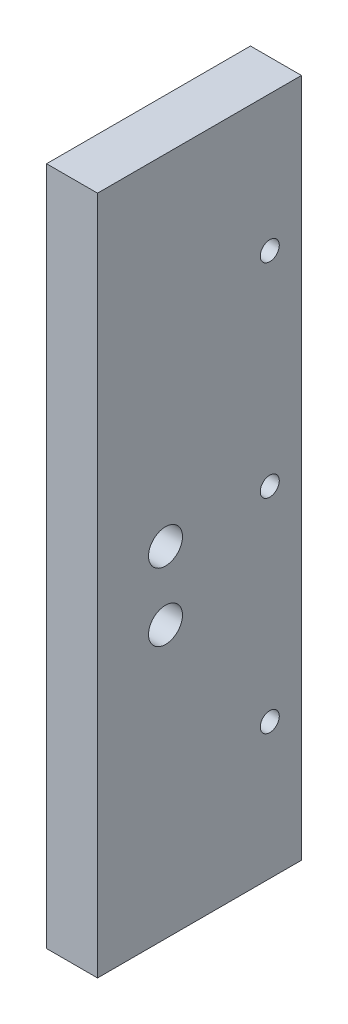
ISO-10303-21;
HEADER;
FILE_DESCRIPTION(('STEP AP214'),'2;1');
FILE_NAME('part.step','',(''),(''),'','','');
FILE_SCHEMA(('AUTOMOTIVE_DESIGN { 1 0 10303 214 1 1 1 1 }'));
ENDSEC;
DATA;
#1=APPLICATION_CONTEXT('core data for automotive mechanical design processes');
#2=APPLICATION_PROTOCOL_DEFINITION('international standard','automotive_design',2000,#1);
#3=PRODUCT_CONTEXT('',#1,'mechanical');
#4=PRODUCT('Part','Part','',(#3));
#5=PRODUCT_RELATED_PRODUCT_CATEGORY('part','',(#4));
#6=PRODUCT_DEFINITION_FORMATION('','',#4);
#7=PRODUCT_DEFINITION_CONTEXT('part definition',#1,'design');
#8=PRODUCT_DEFINITION('design','',#6,#7);
#9=PRODUCT_DEFINITION_SHAPE('','',#8);
#10=(LENGTH_UNIT() NAMED_UNIT(*) SI_UNIT(.MILLI.,.METRE.));
#11=(NAMED_UNIT(*) PLANE_ANGLE_UNIT() SI_UNIT($,.RADIAN.));
#12=(NAMED_UNIT(*) SI_UNIT($,.STERADIAN.) SOLID_ANGLE_UNIT());
#13=UNCERTAINTY_MEASURE_WITH_UNIT(LENGTH_MEASURE(1.E-05),#10,'distance_accuracy_value','');
#14=(GEOMETRIC_REPRESENTATION_CONTEXT(3) GLOBAL_UNCERTAINTY_ASSIGNED_CONTEXT((#13)) GLOBAL_UNIT_ASSIGNED_CONTEXT((#10,
#11,#12)) REPRESENTATION_CONTEXT('',''));
#15=CARTESIAN_POINT('',(0.,0.,0.));
#16=DIRECTION('',(0.,0.,1.));
#17=DIRECTION('',(1.,0.,0.));
#18=AXIS2_PLACEMENT_3D('',#15,#16,#17);
#19=CARTESIAN_POINT('',(0.,0.,38.1));
#20=DIRECTION('',(1.,0.,0.));
#21=DIRECTION('',(0.,0.,-1.));
#22=AXIS2_PLACEMENT_3D('',#19,#20,#21);
#23=PLANE('',#22);
#24=CARTESIAN_POINT('',(0.,50.8,25.4));
#25=DIRECTION('',(1.,0.,0.));
#26=DIRECTION('',(0.,0.,-1.));
#27=AXIS2_PLACEMENT_3D('',#24,#25,#26);
#28=CIRCLE('',#27,3.175);
#29=CARTESIAN_POINT('',(0.,50.8,22.225));
#30=VERTEX_POINT('',#29);
#31=EDGE_CURVE('E132',#30,#30,#28,.T.);
#32=ORIENTED_EDGE('',*,*,#31,.T.);
#33=EDGE_LOOP('',(#32));
#34=FACE_BOUND('',#33,.T.);
#35=CARTESIAN_POINT('',(0.,63.5,25.4));
#36=DIRECTION('',(1.,0.,0.));
#37=DIRECTION('',(0.,0.,-1.));
#38=AXIS2_PLACEMENT_3D('',#35,#36,#37);
#39=CIRCLE('',#38,3.175);
#40=CARTESIAN_POINT('',(0.,63.5,22.225));
#41=VERTEX_POINT('',#40);
#42=EDGE_CURVE('E124',#41,#41,#39,.T.);
#43=ORIENTED_EDGE('',*,*,#42,.T.);
#44=EDGE_LOOP('',(#43));
#45=FACE_BOUND('',#44,.T.);
#46=CARTESIAN_POINT('',(0.,25.4,5.91820000000001));
#47=DIRECTION('',(-1.,0.,0.));
#48=DIRECTION('',(0.,0.,1.));
#49=AXIS2_PLACEMENT_3D('',#46,#47,#48);
#50=CIRCLE('',#49,1.778);
#51=CARTESIAN_POINT('',(0.,25.4,7.69620000000001));
#52=VERTEX_POINT('',#51);
#53=EDGE_CURVE('E121',#52,#52,#50,.T.);
#54=ORIENTED_EDGE('',*,*,#53,.F.);
#55=EDGE_LOOP('',(#54));
#56=FACE_BOUND('',#55,.T.);
#57=CARTESIAN_POINT('',(0.,63.5,5.91820000000001));
#58=DIRECTION('',(-1.,0.,0.));
#59=DIRECTION('',(0.,0.,1.));
#60=AXIS2_PLACEMENT_3D('',#57,#58,#59);
#61=CIRCLE('',#60,1.778);
#62=CARTESIAN_POINT('',(0.,63.5,7.69620000000001));
#63=VERTEX_POINT('',#62);
#64=EDGE_CURVE('E115',#63,#63,#61,.T.);
#65=ORIENTED_EDGE('',*,*,#64,.F.);
#66=EDGE_LOOP('',(#65));
#67=FACE_BOUND('',#66,.T.);
#68=CARTESIAN_POINT('',(0.,101.6,5.9182));
#69=DIRECTION('',(-1.,0.,0.));
#70=DIRECTION('',(0.,0.,1.));
#71=AXIS2_PLACEMENT_3D('',#68,#69,#70);
#72=CIRCLE('',#71,1.778);
#73=CARTESIAN_POINT('',(0.,101.6,7.6962));
#74=VERTEX_POINT('',#73);
#75=EDGE_CURVE('E109',#74,#74,#72,.T.);
#76=ORIENTED_EDGE('',*,*,#75,.F.);
#77=EDGE_LOOP('',(#76));
#78=FACE_BOUND('',#77,.T.);
#79=DIRECTION('',(0.,-1.,0.));
#80=VECTOR('',#79,1.);
#81=CARTESIAN_POINT('',(0.,0.,0.));
#82=LINE('',#81,#80);
#83=CARTESIAN_POINT('',(0.,127.,0.));
#84=VERTEX_POINT('',#83);
#85=CARTESIAN_POINT('',(0.,0.,0.));
#86=VERTEX_POINT('',#85);
#87=EDGE_CURVE('E95',#84,#86,#82,.T.);
#88=ORIENTED_EDGE('',*,*,#87,.T.);
#89=DIRECTION('',(0.,0.,-1.));
#90=VECTOR('',#89,1.);
#91=CARTESIAN_POINT('',(0.,0.,38.1));
#92=LINE('',#91,#90);
#93=CARTESIAN_POINT('',(0.,0.,38.1));
#94=VERTEX_POINT('',#93);
#95=EDGE_CURVE('E11',#94,#86,#92,.T.);
#96=ORIENTED_EDGE('',*,*,#95,.F.);
#97=DIRECTION('',(0.,-1.,0.));
#98=VECTOR('',#97,1.);
#99=CARTESIAN_POINT('',(0.,0.,38.1));
#100=LINE('',#99,#98);
#101=CARTESIAN_POINT('',(0.,127.,38.1));
#102=VERTEX_POINT('',#101);
#103=EDGE_CURVE('E83',#102,#94,#100,.T.);
#104=ORIENTED_EDGE('',*,*,#103,.F.);
#105=DIRECTION('',(0.,0.,-1.));
#106=VECTOR('',#105,1.);
#107=CARTESIAN_POINT('',(0.,127.,38.1));
#108=LINE('',#107,#106);
#109=EDGE_CURVE('E91',#102,#84,#108,.T.);
#110=ORIENTED_EDGE('',*,*,#109,.T.);
#111=EDGE_LOOP('',(#88,#96,#104,#110));
#112=FACE_BOUND('',#111,.T.);
#113=ADVANCED_FACE('F32',(#34,#45,#56,#67,#78,#112),#23,.F.);
#114=CARTESIAN_POINT('',(0.,0.,38.1));
#115=DIRECTION('',(0.,1.,0.));
#116=DIRECTION('',(0.,0.,1.));
#117=AXIS2_PLACEMENT_3D('',#114,#115,#116);
#118=PLANE('',#117);
#119=DIRECTION('',(1.,0.,0.));
#120=VECTOR('',#119,1.);
#121=CARTESIAN_POINT('',(0.,0.,0.));
#122=LINE('',#121,#120);
#123=CARTESIAN_POINT('',(9.52500000000001,0.,0.));
#124=VERTEX_POINT('',#123);
#125=EDGE_CURVE('E87',#86,#124,#122,.T.);
#126=ORIENTED_EDGE('',*,*,#125,.T.);
#127=DIRECTION('',(0.,0.,-1.));
#128=VECTOR('',#127,1.);
#129=CARTESIAN_POINT('',(9.52500000000001,0.,38.1));
#130=LINE('',#129,#128);
#131=CARTESIAN_POINT('',(9.52500000000001,0.,38.1));
#132=VERTEX_POINT('',#131);
#133=EDGE_CURVE('E40',#132,#124,#130,.T.);
#134=ORIENTED_EDGE('',*,*,#133,.F.);
#135=DIRECTION('',(1.,0.,0.));
#136=VECTOR('',#135,1.);
#137=CARTESIAN_POINT('',(0.,0.,38.1));
#138=LINE('',#137,#136);
#139=EDGE_CURVE('E78',#94,#132,#138,.T.);
#140=ORIENTED_EDGE('',*,*,#139,.F.);
#141=ORIENTED_EDGE('',*,*,#95,.T.);
#142=EDGE_LOOP('',(#126,#134,#140,#141));
#143=FACE_BOUND('',#142,.T.);
#144=ADVANCED_FACE('F86',(#143),#118,.F.);
#145=CARTESIAN_POINT('',(9.52500000000001,0.,38.1));
#146=DIRECTION('',(-1.,0.,0.));
#147=DIRECTION('',(0.,-1.,0.));
#148=AXIS2_PLACEMENT_3D('',#145,#146,#147);
#149=PLANE('',#148);
#150=CARTESIAN_POINT('',(9.525,50.8,25.4));
#151=DIRECTION('',(1.,0.,0.));
#152=DIRECTION('',(0.,1.,0.));
#153=AXIS2_PLACEMENT_3D('',#150,#151,#152);
#154=CIRCLE('',#153,3.175);
#155=CARTESIAN_POINT('',(9.525,53.975,25.4));
#156=VERTEX_POINT('',#155);
#157=EDGE_CURVE('E135',#156,#156,#154,.T.);
#158=ORIENTED_EDGE('',*,*,#157,.F.);
#159=EDGE_LOOP('',(#158));
#160=FACE_BOUND('',#159,.T.);
#161=CARTESIAN_POINT('',(9.525,63.5,25.4));
#162=DIRECTION('',(1.,0.,0.));
#163=DIRECTION('',(0.,1.,0.));
#164=AXIS2_PLACEMENT_3D('',#161,#162,#163);
#165=CIRCLE('',#164,3.175);
#166=CARTESIAN_POINT('',(9.525,66.675,25.4));
#167=VERTEX_POINT('',#166);
#168=EDGE_CURVE('E129',#167,#167,#165,.T.);
#169=ORIENTED_EDGE('',*,*,#168,.F.);
#170=EDGE_LOOP('',(#169));
#171=FACE_BOUND('',#170,.T.);
#172=CARTESIAN_POINT('',(9.52500000000001,25.4,5.91820000000001));
#173=DIRECTION('',(-1.,0.,0.));
#174=DIRECTION('',(0.,0.,1.));
#175=AXIS2_PLACEMENT_3D('',#172,#173,#174);
#176=CIRCLE('',#175,1.778);
#177=CARTESIAN_POINT('',(9.52500000000001,25.4,7.69620000000001));
#178=VERTEX_POINT('',#177);
#179=EDGE_CURVE('E118',#178,#178,#176,.T.);
#180=ORIENTED_EDGE('',*,*,#179,.T.);
#181=EDGE_LOOP('',(#180));
#182=FACE_BOUND('',#181,.T.);
#183=CARTESIAN_POINT('',(9.52500000000001,63.5,5.91820000000001));
#184=DIRECTION('',(-1.,0.,0.));
#185=DIRECTION('',(0.,0.,1.));
#186=AXIS2_PLACEMENT_3D('',#183,#184,#185);
#187=CIRCLE('',#186,1.778);
#188=CARTESIAN_POINT('',(9.52500000000001,63.5,7.69620000000001));
#189=VERTEX_POINT('',#188);
#190=EDGE_CURVE('E112',#189,#189,#187,.T.);
#191=ORIENTED_EDGE('',*,*,#190,.T.);
#192=EDGE_LOOP('',(#191));
#193=FACE_BOUND('',#192,.T.);
#194=CARTESIAN_POINT('',(9.52500000000001,101.6,5.9182));
#195=DIRECTION('',(-1.,0.,0.));
#196=DIRECTION('',(0.,0.,1.));
#197=AXIS2_PLACEMENT_3D('',#194,#195,#196);
#198=CIRCLE('',#197,1.778);
#199=CARTESIAN_POINT('',(9.52500000000001,101.6,7.6962));
#200=VERTEX_POINT('',#199);
#201=EDGE_CURVE('E98',#200,#200,#198,.T.);
#202=ORIENTED_EDGE('',*,*,#201,.T.);
#203=EDGE_LOOP('',(#202));
#204=FACE_BOUND('',#203,.T.);
#205=DIRECTION('',(0.,1.,0.));
#206=VECTOR('',#205,1.);
#207=CARTESIAN_POINT('',(9.52500000000001,0.,0.));
#208=LINE('',#207,#206);
#209=CARTESIAN_POINT('',(9.525,127.,0.));
#210=VERTEX_POINT('',#209);
#211=EDGE_CURVE('E65',#124,#210,#208,.T.);
#212=ORIENTED_EDGE('',*,*,#211,.T.);
#213=DIRECTION('',(0.,0.,-1.));
#214=VECTOR('',#213,1.);
#215=CARTESIAN_POINT('',(9.525,127.,38.1));
#216=LINE('',#215,#214);
#217=CARTESIAN_POINT('',(9.525,127.,38.1));
#218=VERTEX_POINT('',#217);
#219=EDGE_CURVE('E88',#218,#210,#216,.T.);
#220=ORIENTED_EDGE('',*,*,#219,.F.);
#221=DIRECTION('',(0.,1.,0.));
#222=VECTOR('',#221,1.);
#223=CARTESIAN_POINT('',(9.52500000000001,0.,38.1));
#224=LINE('',#223,#222);
#225=EDGE_CURVE('E81',#132,#218,#224,.T.);
#226=ORIENTED_EDGE('',*,*,#225,.F.);
#227=ORIENTED_EDGE('',*,*,#133,.T.);
#228=EDGE_LOOP('',(#212,#220,#226,#227));
#229=FACE_BOUND('',#228,.T.);
#230=ADVANCED_FACE('F89',(#160,#171,#182,#193,#204,#229),#149,.F.);
#231=CARTESIAN_POINT('',(0.,127.,38.1));
#232=DIRECTION('',(0.,-1.,0.));
#233=DIRECTION('',(0.,0.,-1.));
#234=AXIS2_PLACEMENT_3D('',#231,#232,#233);
#235=PLANE('',#234);
#236=DIRECTION('',(-1.,0.,0.));
#237=VECTOR('',#236,1.);
#238=CARTESIAN_POINT('',(0.,127.,0.));
#239=LINE('',#238,#237);
#240=EDGE_CURVE('E71',#210,#84,#239,.T.);
#241=ORIENTED_EDGE('',*,*,#240,.T.);
#242=ORIENTED_EDGE('',*,*,#109,.F.);
#243=DIRECTION('',(-1.,0.,0.));
#244=VECTOR('',#243,1.);
#245=CARTESIAN_POINT('',(0.,127.,38.1));
#246=LINE('',#245,#244);
#247=EDGE_CURVE('E48',#218,#102,#246,.T.);
#248=ORIENTED_EDGE('',*,*,#247,.F.);
#249=ORIENTED_EDGE('',*,*,#219,.T.);
#250=EDGE_LOOP('',(#241,#242,#248,#249));
#251=FACE_BOUND('',#250,.T.);
#252=ADVANCED_FACE('F103',(#251),#235,.F.);
#253=CARTESIAN_POINT('',(0.,0.,38.1));
#254=DIRECTION('',(0.,0.,-1.));
#255=DIRECTION('',(-1.,0.,0.));
#256=AXIS2_PLACEMENT_3D('',#253,#254,#255);
#257=PLANE('',#256);
#258=ORIENTED_EDGE('',*,*,#103,.T.);
#259=ORIENTED_EDGE('',*,*,#139,.T.);
#260=ORIENTED_EDGE('',*,*,#225,.T.);
#261=ORIENTED_EDGE('',*,*,#247,.T.);
#262=EDGE_LOOP('',(#258,#259,#260,#261));
#263=FACE_BOUND('',#262,.T.);
#264=ADVANCED_FACE('F79',(#263),#257,.F.);
#265=CARTESIAN_POINT('',(0.,0.,0.));
#266=DIRECTION('',(0.,0.,-1.));
#267=DIRECTION('',(-1.,0.,0.));
#268=AXIS2_PLACEMENT_3D('',#265,#266,#267);
#269=PLANE('',#268);
#270=ORIENTED_EDGE('',*,*,#87,.F.);
#271=ORIENTED_EDGE('',*,*,#240,.F.);
#272=ORIENTED_EDGE('',*,*,#211,.F.);
#273=ORIENTED_EDGE('',*,*,#125,.F.);
#274=EDGE_LOOP('',(#270,#271,#272,#273));
#275=FACE_BOUND('',#274,.T.);
#276=ADVANCED_FACE('F106',(#275),#269,.T.);
#277=CARTESIAN_POINT('',(9.52500000000001,101.6,5.9182));
#278=DIRECTION('',(-1.,0.,0.));
#279=DIRECTION('',(0.,0.,1.));
#280=AXIS2_PLACEMENT_3D('',#277,#278,#279);
#281=CYLINDRICAL_SURFACE('',#280,1.778);
#282=ORIENTED_EDGE('',*,*,#201,.F.);
#283=EDGE_LOOP('',(#282));
#284=FACE_BOUND('',#283,.T.);
#285=ORIENTED_EDGE('',*,*,#75,.T.);
#286=EDGE_LOOP('',(#285));
#287=FACE_BOUND('',#286,.T.);
#288=ADVANCED_FACE('F153',(#284,#287),#281,.F.);
#289=CARTESIAN_POINT('',(9.52500000000001,63.5,5.91820000000001));
#290=DIRECTION('',(-1.,0.,0.));
#291=DIRECTION('',(0.,0.,1.));
#292=AXIS2_PLACEMENT_3D('',#289,#290,#291);
#293=CYLINDRICAL_SURFACE('',#292,1.778);
#294=ORIENTED_EDGE('',*,*,#190,.F.);
#295=EDGE_LOOP('',(#294));
#296=FACE_BOUND('',#295,.T.);
#297=ORIENTED_EDGE('',*,*,#64,.T.);
#298=EDGE_LOOP('',(#297));
#299=FACE_BOUND('',#298,.T.);
#300=ADVANCED_FACE('F156',(#296,#299),#293,.F.);
#301=CARTESIAN_POINT('',(9.52500000000001,25.4,5.91820000000001));
#302=DIRECTION('',(-1.,0.,0.));
#303=DIRECTION('',(0.,0.,1.));
#304=AXIS2_PLACEMENT_3D('',#301,#302,#303);
#305=CYLINDRICAL_SURFACE('',#304,1.778);
#306=ORIENTED_EDGE('',*,*,#179,.F.);
#307=EDGE_LOOP('',(#306));
#308=FACE_BOUND('',#307,.T.);
#309=ORIENTED_EDGE('',*,*,#53,.T.);
#310=EDGE_LOOP('',(#309));
#311=FACE_BOUND('',#310,.T.);
#312=ADVANCED_FACE('F174',(#308,#311),#305,.F.);
#313=CARTESIAN_POINT('',(-28.575,63.5,25.4));
#314=DIRECTION('',(1.,0.,0.));
#315=DIRECTION('',(0.,1.,0.));
#316=AXIS2_PLACEMENT_3D('',#313,#314,#315);
#317=CYLINDRICAL_SURFACE('',#316,3.175);
#318=ORIENTED_EDGE('',*,*,#168,.T.);
#319=EDGE_LOOP('',(#318));
#320=FACE_BOUND('',#319,.T.);
#321=ORIENTED_EDGE('',*,*,#42,.F.);
#322=EDGE_LOOP('',(#321));
#323=FACE_BOUND('',#322,.T.);
#324=ADVANCED_FACE('F180',(#320,#323),#317,.F.);
#325=CARTESIAN_POINT('',(-28.575,50.8,25.4));
#326=DIRECTION('',(1.,0.,0.));
#327=DIRECTION('',(0.,1.,0.));
#328=AXIS2_PLACEMENT_3D('',#325,#326,#327);
#329=CYLINDRICAL_SURFACE('',#328,3.175);
#330=ORIENTED_EDGE('',*,*,#157,.T.);
#331=EDGE_LOOP('',(#330));
#332=FACE_BOUND('',#331,.T.);
#333=ORIENTED_EDGE('',*,*,#31,.F.);
#334=EDGE_LOOP('',(#333));
#335=FACE_BOUND('',#334,.T.);
#336=ADVANCED_FACE('F139',(#332,#335),#329,.F.);
#337=CLOSED_SHELL('',(#113,#144,#230,#252,#264,#276,#288,#300,#312,#324,#336));
#338=MANIFOLD_SOLID_BREP('B2',#337);
#339=ADVANCED_BREP_SHAPE_REPRESENTATION('',(#18,#338),#14);
#340=SHAPE_DEFINITION_REPRESENTATION(#9,#339);
ENDSEC;
END-ISO-10303-21;
